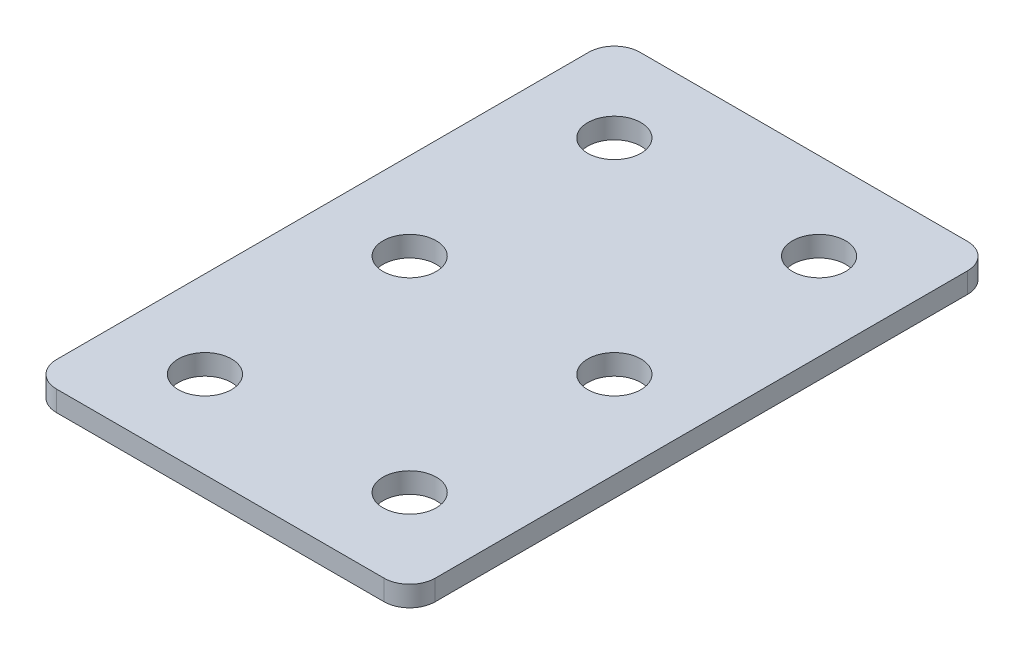
ISO-10303-21;
HEADER;
FILE_DESCRIPTION(('STEP AP214'),'2;1');
FILE_NAME('part.step','',(''),(''),'','','');
FILE_SCHEMA(('AUTOMOTIVE_DESIGN { 1 0 10303 214 1 1 1 1 }'));
ENDSEC;
DATA;
#1=APPLICATION_CONTEXT('core data for automotive mechanical design processes');
#2=APPLICATION_PROTOCOL_DEFINITION('international standard','automotive_design',2000,#1);
#3=PRODUCT_CONTEXT('',#1,'mechanical');
#4=PRODUCT('Part','Part','',(#3));
#5=PRODUCT_RELATED_PRODUCT_CATEGORY('part','',(#4));
#6=PRODUCT_DEFINITION_FORMATION('','',#4);
#7=PRODUCT_DEFINITION_CONTEXT('part definition',#1,'design');
#8=PRODUCT_DEFINITION('design','',#6,#7);
#9=PRODUCT_DEFINITION_SHAPE('','',#8);
#10=(LENGTH_UNIT() NAMED_UNIT(*) SI_UNIT(.MILLI.,.METRE.));
#11=(NAMED_UNIT(*) PLANE_ANGLE_UNIT() SI_UNIT($,.RADIAN.));
#12=(NAMED_UNIT(*) SI_UNIT($,.STERADIAN.) SOLID_ANGLE_UNIT());
#13=UNCERTAINTY_MEASURE_WITH_UNIT(LENGTH_MEASURE(1.E-05),#10,'distance_accuracy_value','');
#14=(GEOMETRIC_REPRESENTATION_CONTEXT(3) GLOBAL_UNCERTAINTY_ASSIGNED_CONTEXT((#13)) GLOBAL_UNIT_ASSIGNED_CONTEXT((#10,
#11,#12)) REPRESENTATION_CONTEXT('',''));
#15=CARTESIAN_POINT('',(0.,0.,0.));
#16=DIRECTION('',(0.,0.,1.));
#17=DIRECTION('',(1.,0.,0.));
#18=AXIS2_PLACEMENT_3D('',#15,#16,#17);
#19=CARTESIAN_POINT('',(-1.77841838404902,2.35790424429661,-21.5789401508641));
#20=DIRECTION('',(0.,-1.,0.));
#21=DIRECTION('',(0.,0.,-1.));
#22=AXIS2_PLACEMENT_3D('',#19,#20,#21);
#23=PLANE('',#22);
#24=CARTESIAN_POINT('',(8.22158161595099,2.35790424429661,18.4210598491359));
#25=DIRECTION('',(0.,1.,0.));
#26=DIRECTION('',(0.,0.,1.));
#27=AXIS2_PLACEMENT_3D('',#24,#25,#26);
#28=CIRCLE('',#27,2.6);
#29=CARTESIAN_POINT('',(8.22158161595099,2.35790424429661,21.0210598491359));
#30=VERTEX_POINT('',#29);
#31=EDGE_CURVE('E177',#30,#30,#28,.T.);
#32=ORIENTED_EDGE('',*,*,#31,.T.);
#33=EDGE_LOOP('',(#32));
#34=FACE_BOUND('',#33,.T.);
#35=CARTESIAN_POINT('',(-11.7784183840491,2.35790424429661,18.4210598491359));
#36=DIRECTION('',(0.,1.,0.));
#37=DIRECTION('',(0.,0.,1.));
#38=AXIS2_PLACEMENT_3D('',#35,#36,#37);
#39=CIRCLE('',#38,2.6);
#40=CARTESIAN_POINT('',(-11.7784183840491,2.35790424429661,21.0210598491359));
#41=VERTEX_POINT('',#40);
#42=EDGE_CURVE('E171',#41,#41,#39,.T.);
#43=ORIENTED_EDGE('',*,*,#42,.T.);
#44=EDGE_LOOP('',(#43));
#45=FACE_BOUND('',#44,.T.);
#46=CARTESIAN_POINT('',(8.22158161595099,2.35790424429661,-1.57894015086408));
#47=DIRECTION('',(0.,1.,0.));
#48=DIRECTION('',(0.,0.,1.));
#49=AXIS2_PLACEMENT_3D('',#46,#47,#48);
#50=CIRCLE('',#49,2.6);
#51=CARTESIAN_POINT('',(8.22158161595099,2.35790424429661,1.02105984913592));
#52=VERTEX_POINT('',#51);
#53=EDGE_CURVE('E165',#52,#52,#50,.T.);
#54=ORIENTED_EDGE('',*,*,#53,.T.);
#55=EDGE_LOOP('',(#54));
#56=FACE_BOUND('',#55,.T.);
#57=CARTESIAN_POINT('',(-11.7784183840491,2.35790424429661,-1.57894015086408));
#58=DIRECTION('',(0.,1.,0.));
#59=DIRECTION('',(0.,0.,1.));
#60=AXIS2_PLACEMENT_3D('',#57,#58,#59);
#61=CIRCLE('',#60,2.6);
#62=CARTESIAN_POINT('',(-11.7784183840491,2.35790424429661,1.02105984913592));
#63=VERTEX_POINT('',#62);
#64=EDGE_CURVE('E159',#63,#63,#61,.T.);
#65=ORIENTED_EDGE('',*,*,#64,.T.);
#66=EDGE_LOOP('',(#65));
#67=FACE_BOUND('',#66,.T.);
#68=CARTESIAN_POINT('',(8.221581615951,2.35790424429661,-21.5789401508641));
#69=DIRECTION('',(0.,1.,0.));
#70=DIRECTION('',(0.,0.,1.));
#71=AXIS2_PLACEMENT_3D('',#68,#69,#70);
#72=CIRCLE('',#71,2.6);
#73=CARTESIAN_POINT('',(8.221581615951,2.35790424429661,-18.9789401508641));
#74=VERTEX_POINT('',#73);
#75=EDGE_CURVE('E154',#74,#74,#72,.T.);
#76=ORIENTED_EDGE('',*,*,#75,.T.);
#77=EDGE_LOOP('',(#76));
#78=FACE_BOUND('',#77,.T.);
#79=CARTESIAN_POINT('',(-11.7784183840491,2.35790424429661,-21.5789401508641));
#80=DIRECTION('',(0.,1.,0.));
#81=DIRECTION('',(0.,0.,1.));
#82=AXIS2_PLACEMENT_3D('',#79,#80,#81);
#83=CIRCLE('',#82,2.6);
#84=CARTESIAN_POINT('',(-11.7784183840491,2.35790424429661,-18.9789401508641));
#85=VERTEX_POINT('',#84);
#86=EDGE_CURVE('E147',#85,#85,#83,.T.);
#87=ORIENTED_EDGE('',*,*,#86,.T.);
#88=EDGE_LOOP('',(#87));
#89=FACE_BOUND('',#88,.T.);
#90=DIRECTION('',(0.,0.,-1.));
#91=VECTOR('',#90,1.);
#92=CARTESIAN_POINT('',(16.721581615951,2.35790424429661,26.9210598491359));
#93=LINE('',#92,#91);
#94=CARTESIAN_POINT('',(16.721581615951,2.35790424429661,24.4210598491359));
#95=VERTEX_POINT('',#94);
#96=CARTESIAN_POINT('',(16.721581615951,2.35790424429661,-27.5789401508641));
#97=VERTEX_POINT('',#96);
#98=EDGE_CURVE('E106',#95,#97,#93,.T.);
#99=ORIENTED_EDGE('',*,*,#98,.F.);
#100=CARTESIAN_POINT('',(14.221581615951,2.35790424429661,24.4210598491359));
#101=DIRECTION('',(0.,-1.,0.));
#102=DIRECTION('',(0.,0.,-1.));
#103=AXIS2_PLACEMENT_3D('',#100,#101,#102);
#104=CIRCLE('',#103,2.5);
#105=CARTESIAN_POINT('',(14.221581615951,2.35790424429661,26.9210598491359));
#106=VERTEX_POINT('',#105);
#107=EDGE_CURVE('E128',#95,#106,#104,.T.);
#108=ORIENTED_EDGE('',*,*,#107,.T.);
#109=DIRECTION('',(1.,0.,0.));
#110=VECTOR('',#109,1.);
#111=CARTESIAN_POINT('',(-20.2784183840491,2.35790424429661,26.9210598491359));
#112=LINE('',#111,#110);
#113=CARTESIAN_POINT('',(-17.7784183840491,2.35790424429661,26.9210598491359));
#114=VERTEX_POINT('',#113);
#115=EDGE_CURVE('E110',#114,#106,#112,.T.);
#116=ORIENTED_EDGE('',*,*,#115,.F.);
#117=CARTESIAN_POINT('',(-17.7784183840491,2.35790424429661,24.4210598491359));
#118=DIRECTION('',(0.,-1.,0.));
#119=DIRECTION('',(0.,0.,-1.));
#120=AXIS2_PLACEMENT_3D('',#117,#118,#119);
#121=CIRCLE('',#120,2.5);
#122=CARTESIAN_POINT('',(-20.2784183840491,2.35790424429661,24.4210598491359));
#123=VERTEX_POINT('',#122);
#124=EDGE_CURVE('E105',#114,#123,#121,.T.);
#125=ORIENTED_EDGE('',*,*,#124,.T.);
#126=DIRECTION('',(0.,0.,1.));
#127=VECTOR('',#126,1.);
#128=CARTESIAN_POINT('',(-20.2784183840491,2.35790424429661,-30.0789401508641));
#129=LINE('',#128,#127);
#130=CARTESIAN_POINT('',(-20.2784183840491,2.35790424429661,-27.5789401508641));
#131=VERTEX_POINT('',#130);
#132=EDGE_CURVE('E137',#131,#123,#129,.T.);
#133=ORIENTED_EDGE('',*,*,#132,.F.);
#134=CARTESIAN_POINT('',(-17.7784183840491,2.35790424429661,-27.5789401508641));
#135=DIRECTION('',(0.,-1.,0.));
#136=DIRECTION('',(0.,0.,-1.));
#137=AXIS2_PLACEMENT_3D('',#134,#135,#136);
#138=CIRCLE('',#137,2.5);
#139=CARTESIAN_POINT('',(-17.7784183840491,2.35790424429661,-30.0789401508641));
#140=VERTEX_POINT('',#139);
#141=EDGE_CURVE('E31',#131,#140,#138,.T.);
#142=ORIENTED_EDGE('',*,*,#141,.T.);
#143=DIRECTION('',(-1.,0.,0.));
#144=VECTOR('',#143,1.);
#145=CARTESIAN_POINT('',(16.721581615951,2.35790424429661,-30.0789401508641));
#146=LINE('',#145,#144);
#147=CARTESIAN_POINT('',(14.221581615951,2.35790424429661,-30.0789401508641));
#148=VERTEX_POINT('',#147);
#149=EDGE_CURVE('E138',#148,#140,#146,.T.);
#150=ORIENTED_EDGE('',*,*,#149,.F.);
#151=CARTESIAN_POINT('',(14.221581615951,2.35790424429661,-27.5789401508641));
#152=DIRECTION('',(0.,-1.,0.));
#153=DIRECTION('',(0.,0.,-1.));
#154=AXIS2_PLACEMENT_3D('',#151,#152,#153);
#155=CIRCLE('',#154,2.5);
#156=EDGE_CURVE('E126',#148,#97,#155,.T.);
#157=ORIENTED_EDGE('',*,*,#156,.T.);
#158=EDGE_LOOP('',(#99,#108,#116,#125,#133,#142,#150,#157));
#159=FACE_BOUND('',#158,.T.);
#160=ADVANCED_FACE('F16',(#34,#45,#56,#67,#78,#89,#159),#23,.T.);
#161=CARTESIAN_POINT('',(16.721581615951,2.35790424429661,-30.0789401508641));
#162=DIRECTION('',(0.,0.,-1.));
#163=DIRECTION('',(-1.,0.,0.));
#164=AXIS2_PLACEMENT_3D('',#161,#162,#163);
#165=PLANE('',#164);
#166=DIRECTION('',(-1.,0.,0.));
#167=VECTOR('',#166,1.);
#168=CARTESIAN_POINT('',(16.721581615951,4.35790424429661,-30.0789401508641));
#169=LINE('',#168,#167);
#170=CARTESIAN_POINT('',(14.221581615951,4.35790424429661,-30.0789401508641));
#171=VERTEX_POINT('',#170);
#172=CARTESIAN_POINT('',(-17.7784183840491,4.35790424429661,-30.0789401508641));
#173=VERTEX_POINT('',#172);
#174=EDGE_CURVE('E144',#171,#173,#169,.T.);
#175=ORIENTED_EDGE('',*,*,#174,.F.);
#176=DIRECTION('',(0.,1.,0.));
#177=VECTOR('',#176,1.);
#178=CARTESIAN_POINT('',(14.221581615951,2.35790424429661,-30.0789401508641));
#179=LINE('',#178,#177);
#180=EDGE_CURVE('E38',#171,#148,#179,.F.);
#181=ORIENTED_EDGE('',*,*,#180,.T.);
#182=ORIENTED_EDGE('',*,*,#149,.T.);
#183=DIRECTION('',(0.,1.,0.));
#184=VECTOR('',#183,1.);
#185=CARTESIAN_POINT('',(-17.7784183840491,2.35790424429661,-30.0789401508641));
#186=LINE('',#185,#184);
#187=EDGE_CURVE('E130',#140,#173,#186,.T.);
#188=ORIENTED_EDGE('',*,*,#187,.T.);
#189=EDGE_LOOP('',(#175,#181,#182,#188));
#190=FACE_BOUND('',#189,.T.);
#191=ADVANCED_FACE('F223',(#190),#165,.T.);
#192=CARTESIAN_POINT('',(16.721581615951,2.35790424429661,26.9210598491359));
#193=DIRECTION('',(1.,0.,0.));
#194=DIRECTION('',(0.,0.,-1.));
#195=AXIS2_PLACEMENT_3D('',#192,#193,#194);
#196=PLANE('',#195);
#197=DIRECTION('',(0.,0.,-1.));
#198=VECTOR('',#197,1.);
#199=CARTESIAN_POINT('',(16.721581615951,4.35790424429661,26.9210598491359));
#200=LINE('',#199,#198);
#201=CARTESIAN_POINT('',(16.721581615951,4.35790424429661,24.4210598491359));
#202=VERTEX_POINT('',#201);
#203=CARTESIAN_POINT('',(16.721581615951,4.35790424429661,-27.5789401508641));
#204=VERTEX_POINT('',#203);
#205=EDGE_CURVE('E102',#202,#204,#200,.T.);
#206=ORIENTED_EDGE('',*,*,#205,.F.);
#207=DIRECTION('',(0.,1.,0.));
#208=VECTOR('',#207,1.);
#209=CARTESIAN_POINT('',(16.721581615951,2.35790424429661,24.4210598491359));
#210=LINE('',#209,#208);
#211=EDGE_CURVE('E122',#202,#95,#210,.F.);
#212=ORIENTED_EDGE('',*,*,#211,.T.);
#213=ORIENTED_EDGE('',*,*,#98,.T.);
#214=DIRECTION('',(0.,1.,0.));
#215=VECTOR('',#214,1.);
#216=CARTESIAN_POINT('',(16.721581615951,2.35790424429661,-27.5789401508641));
#217=LINE('',#216,#215);
#218=EDGE_CURVE('E119',#97,#204,#217,.T.);
#219=ORIENTED_EDGE('',*,*,#218,.T.);
#220=EDGE_LOOP('',(#206,#212,#213,#219));
#221=FACE_BOUND('',#220,.T.);
#222=ADVANCED_FACE('F228',(#221),#196,.T.);
#223=CARTESIAN_POINT('',(-20.2784183840491,2.35790424429661,26.9210598491359));
#224=DIRECTION('',(0.,0.,1.));
#225=DIRECTION('',(1.,0.,0.));
#226=AXIS2_PLACEMENT_3D('',#223,#224,#225);
#227=PLANE('',#226);
#228=ORIENTED_EDGE('',*,*,#115,.T.);
#229=DIRECTION('',(0.,1.,0.));
#230=VECTOR('',#229,1.);
#231=CARTESIAN_POINT('',(14.221581615951,2.35790424429661,26.9210598491359));
#232=LINE('',#231,#230);
#233=CARTESIAN_POINT('',(14.221581615951,4.35790424429661,26.9210598491359));
#234=VERTEX_POINT('',#233);
#235=EDGE_CURVE('E93',#106,#234,#232,.T.);
#236=ORIENTED_EDGE('',*,*,#235,.T.);
#237=DIRECTION('',(1.,0.,0.));
#238=VECTOR('',#237,1.);
#239=CARTESIAN_POINT('',(-20.2784183840491,4.35790424429661,26.9210598491359));
#240=LINE('',#239,#238);
#241=CARTESIAN_POINT('',(-17.7784183840491,4.35790424429661,26.9210598491359));
#242=VERTEX_POINT('',#241);
#243=EDGE_CURVE('E85',#242,#234,#240,.T.);
#244=ORIENTED_EDGE('',*,*,#243,.F.);
#245=DIRECTION('',(0.,1.,0.));
#246=VECTOR('',#245,1.);
#247=CARTESIAN_POINT('',(-17.7784183840491,2.35790424429661,26.9210598491359));
#248=LINE('',#247,#246);
#249=EDGE_CURVE('E99',#242,#114,#248,.F.);
#250=ORIENTED_EDGE('',*,*,#249,.T.);
#251=EDGE_LOOP('',(#228,#236,#244,#250));
#252=FACE_BOUND('',#251,.T.);
#253=ADVANCED_FACE('F98',(#252),#227,.T.);
#254=CARTESIAN_POINT('',(-20.2784183840491,2.35790424429661,-30.0789401508641));
#255=DIRECTION('',(-1.,0.,0.));
#256=DIRECTION('',(0.,0.,1.));
#257=AXIS2_PLACEMENT_3D('',#254,#255,#256);
#258=PLANE('',#257);
#259=DIRECTION('',(0.,0.,1.));
#260=VECTOR('',#259,1.);
#261=CARTESIAN_POINT('',(-20.2784183840491,4.35790424429661,-30.0789401508641));
#262=LINE('',#261,#260);
#263=CARTESIAN_POINT('',(-20.2784183840491,4.35790424429661,-27.5789401508641));
#264=VERTEX_POINT('',#263);
#265=CARTESIAN_POINT('',(-20.2784183840491,4.35790424429661,24.4210598491359));
#266=VERTEX_POINT('',#265);
#267=EDGE_CURVE('E87',#264,#266,#262,.T.);
#268=ORIENTED_EDGE('',*,*,#267,.F.);
#269=DIRECTION('',(0.,1.,0.));
#270=VECTOR('',#269,1.);
#271=CARTESIAN_POINT('',(-20.2784183840491,2.35790424429661,-27.5789401508641));
#272=LINE('',#271,#270);
#273=EDGE_CURVE('E10',#264,#131,#272,.F.);
#274=ORIENTED_EDGE('',*,*,#273,.T.);
#275=ORIENTED_EDGE('',*,*,#132,.T.);
#276=DIRECTION('',(0.,1.,0.));
#277=VECTOR('',#276,1.);
#278=CARTESIAN_POINT('',(-20.2784183840491,2.35790424429661,24.4210598491359));
#279=LINE('',#278,#277);
#280=EDGE_CURVE('E24',#123,#266,#279,.T.);
#281=ORIENTED_EDGE('',*,*,#280,.T.);
#282=EDGE_LOOP('',(#268,#274,#275,#281));
#283=FACE_BOUND('',#282,.T.);
#284=ADVANCED_FACE('F135',(#283),#258,.T.);
#285=CARTESIAN_POINT('',(-1.77841838404902,4.35790424429661,-21.5789401508641));
#286=DIRECTION('',(0.,-1.,0.));
#287=DIRECTION('',(0.,0.,-1.));
#288=AXIS2_PLACEMENT_3D('',#285,#286,#287);
#289=PLANE('',#288);
#290=CARTESIAN_POINT('',(8.22158161595099,4.35790424429661,18.4210598491359));
#291=DIRECTION('',(0.,1.,0.));
#292=DIRECTION('',(0.,0.,1.));
#293=AXIS2_PLACEMENT_3D('',#290,#291,#292);
#294=CIRCLE('',#293,2.6);
#295=CARTESIAN_POINT('',(8.22158161595099,4.35790424429661,21.0210598491359));
#296=VERTEX_POINT('',#295);
#297=EDGE_CURVE('E180',#296,#296,#294,.T.);
#298=ORIENTED_EDGE('',*,*,#297,.F.);
#299=EDGE_LOOP('',(#298));
#300=FACE_BOUND('',#299,.T.);
#301=CARTESIAN_POINT('',(-11.7784183840491,4.35790424429661,18.4210598491359));
#302=DIRECTION('',(0.,1.,0.));
#303=DIRECTION('',(0.,0.,1.));
#304=AXIS2_PLACEMENT_3D('',#301,#302,#303);
#305=CIRCLE('',#304,2.6);
#306=CARTESIAN_POINT('',(-11.7784183840491,4.35790424429661,21.0210598491359));
#307=VERTEX_POINT('',#306);
#308=EDGE_CURVE('E174',#307,#307,#305,.T.);
#309=ORIENTED_EDGE('',*,*,#308,.F.);
#310=EDGE_LOOP('',(#309));
#311=FACE_BOUND('',#310,.T.);
#312=CARTESIAN_POINT('',(8.22158161595099,4.35790424429661,-1.57894015086408));
#313=DIRECTION('',(0.,1.,0.));
#314=DIRECTION('',(0.,0.,1.));
#315=AXIS2_PLACEMENT_3D('',#312,#313,#314);
#316=CIRCLE('',#315,2.6);
#317=CARTESIAN_POINT('',(8.22158161595099,4.35790424429661,1.02105984913592));
#318=VERTEX_POINT('',#317);
#319=EDGE_CURVE('E168',#318,#318,#316,.T.);
#320=ORIENTED_EDGE('',*,*,#319,.F.);
#321=EDGE_LOOP('',(#320));
#322=FACE_BOUND('',#321,.T.);
#323=CARTESIAN_POINT('',(-11.7784183840491,4.35790424429661,-1.57894015086408));
#324=DIRECTION('',(0.,1.,0.));
#325=DIRECTION('',(0.,0.,1.));
#326=AXIS2_PLACEMENT_3D('',#323,#324,#325);
#327=CIRCLE('',#326,2.6);
#328=CARTESIAN_POINT('',(-11.7784183840491,4.35790424429661,1.02105984913592));
#329=VERTEX_POINT('',#328);
#330=EDGE_CURVE('E162',#329,#329,#327,.T.);
#331=ORIENTED_EDGE('',*,*,#330,.F.);
#332=EDGE_LOOP('',(#331));
#333=FACE_BOUND('',#332,.T.);
#334=CARTESIAN_POINT('',(8.221581615951,4.35790424429661,-21.5789401508641));
#335=DIRECTION('',(0.,1.,0.));
#336=DIRECTION('',(0.,0.,1.));
#337=AXIS2_PLACEMENT_3D('',#334,#335,#336);
#338=CIRCLE('',#337,2.6);
#339=CARTESIAN_POINT('',(8.221581615951,4.35790424429661,-18.9789401508641));
#340=VERTEX_POINT('',#339);
#341=EDGE_CURVE('E156',#340,#340,#338,.T.);
#342=ORIENTED_EDGE('',*,*,#341,.F.);
#343=EDGE_LOOP('',(#342));
#344=FACE_BOUND('',#343,.T.);
#345=CARTESIAN_POINT('',(-11.7784183840491,4.35790424429661,-21.5789401508641));
#346=DIRECTION('',(0.,1.,0.));
#347=DIRECTION('',(0.,0.,1.));
#348=AXIS2_PLACEMENT_3D('',#345,#346,#347);
#349=CIRCLE('',#348,2.6);
#350=CARTESIAN_POINT('',(-11.7784183840491,4.35790424429661,-18.9789401508641));
#351=VERTEX_POINT('',#350);
#352=EDGE_CURVE('E149',#351,#351,#349,.T.);
#353=ORIENTED_EDGE('',*,*,#352,.F.);
#354=EDGE_LOOP('',(#353));
#355=FACE_BOUND('',#354,.T.);
#356=ORIENTED_EDGE('',*,*,#243,.T.);
#357=CARTESIAN_POINT('',(14.221581615951,4.35790424429661,24.4210598491359));
#358=DIRECTION('',(0.,-1.,0.));
#359=DIRECTION('',(0.,0.,-1.));
#360=AXIS2_PLACEMENT_3D('',#357,#358,#359);
#361=CIRCLE('',#360,2.5);
#362=EDGE_CURVE('E117',#234,#202,#361,.F.);
#363=ORIENTED_EDGE('',*,*,#362,.T.);
#364=ORIENTED_EDGE('',*,*,#205,.T.);
#365=CARTESIAN_POINT('',(14.221581615951,4.35790424429661,-27.5789401508641));
#366=DIRECTION('',(0.,-1.,0.));
#367=DIRECTION('',(0.,0.,-1.));
#368=AXIS2_PLACEMENT_3D('',#365,#366,#367);
#369=CIRCLE('',#368,2.5);
#370=EDGE_CURVE('E115',#204,#171,#369,.F.);
#371=ORIENTED_EDGE('',*,*,#370,.T.);
#372=ORIENTED_EDGE('',*,*,#174,.T.);
#373=CARTESIAN_POINT('',(-17.7784183840491,4.35790424429661,-27.5789401508641));
#374=DIRECTION('',(0.,-1.,0.));
#375=DIRECTION('',(0.,0.,-1.));
#376=AXIS2_PLACEMENT_3D('',#373,#374,#375);
#377=CIRCLE('',#376,2.5);
#378=EDGE_CURVE('E92',#173,#264,#377,.F.);
#379=ORIENTED_EDGE('',*,*,#378,.T.);
#380=ORIENTED_EDGE('',*,*,#267,.T.);
#381=CARTESIAN_POINT('',(-17.7784183840491,4.35790424429661,24.4210598491359));
#382=DIRECTION('',(0.,-1.,0.));
#383=DIRECTION('',(0.,0.,-1.));
#384=AXIS2_PLACEMENT_3D('',#381,#382,#383);
#385=CIRCLE('',#384,2.5);
#386=EDGE_CURVE('E82',#266,#242,#385,.F.);
#387=ORIENTED_EDGE('',*,*,#386,.T.);
#388=EDGE_LOOP('',(#356,#363,#364,#371,#372,#379,#380,#387));
#389=FACE_BOUND('',#388,.T.);
#390=ADVANCED_FACE('F84',(#300,#311,#322,#333,#344,#355,#389),#289,.F.);
#391=CARTESIAN_POINT('',(-11.7784183840491,2.35790424429661,-21.5789401508641));
#392=DIRECTION('',(0.,1.,0.));
#393=DIRECTION('',(0.,0.,1.));
#394=AXIS2_PLACEMENT_3D('',#391,#392,#393);
#395=CYLINDRICAL_SURFACE('',#394,2.6);
#396=ORIENTED_EDGE('',*,*,#86,.F.);
#397=EDGE_LOOP('',(#396));
#398=FACE_BOUND('',#397,.T.);
#399=ORIENTED_EDGE('',*,*,#352,.T.);
#400=EDGE_LOOP('',(#399));
#401=FACE_BOUND('',#400,.T.);
#402=ADVANCED_FACE('F198',(#398,#401),#395,.F.);
#403=CARTESIAN_POINT('',(8.221581615951,2.35790424429661,-21.5789401508641));
#404=DIRECTION('',(0.,1.,0.));
#405=DIRECTION('',(0.,0.,1.));
#406=AXIS2_PLACEMENT_3D('',#403,#404,#405);
#407=CYLINDRICAL_SURFACE('',#406,2.6);
#408=ORIENTED_EDGE('',*,*,#75,.F.);
#409=EDGE_LOOP('',(#408));
#410=FACE_BOUND('',#409,.T.);
#411=ORIENTED_EDGE('',*,*,#341,.T.);
#412=EDGE_LOOP('',(#411));
#413=FACE_BOUND('',#412,.T.);
#414=ADVANCED_FACE('F211',(#410,#413),#407,.F.);
#415=CARTESIAN_POINT('',(-11.7784183840491,2.35790424429661,-1.57894015086408));
#416=DIRECTION('',(0.,1.,0.));
#417=DIRECTION('',(0.,0.,1.));
#418=AXIS2_PLACEMENT_3D('',#415,#416,#417);
#419=CYLINDRICAL_SURFACE('',#418,2.6);
#420=ORIENTED_EDGE('',*,*,#64,.F.);
#421=EDGE_LOOP('',(#420));
#422=FACE_BOUND('',#421,.T.);
#423=ORIENTED_EDGE('',*,*,#330,.T.);
#424=EDGE_LOOP('',(#423));
#425=FACE_BOUND('',#424,.T.);
#426=ADVANCED_FACE('F218',(#422,#425),#419,.F.);
#427=CARTESIAN_POINT('',(8.22158161595099,2.35790424429661,-1.57894015086408));
#428=DIRECTION('',(0.,1.,0.));
#429=DIRECTION('',(0.,0.,1.));
#430=AXIS2_PLACEMENT_3D('',#427,#428,#429);
#431=CYLINDRICAL_SURFACE('',#430,2.6);
#432=ORIENTED_EDGE('',*,*,#53,.F.);
#433=EDGE_LOOP('',(#432));
#434=FACE_BOUND('',#433,.T.);
#435=ORIENTED_EDGE('',*,*,#319,.T.);
#436=EDGE_LOOP('',(#435));
#437=FACE_BOUND('',#436,.T.);
#438=ADVANCED_FACE('F291',(#434,#437),#431,.F.);
#439=CARTESIAN_POINT('',(-11.7784183840491,2.35790424429661,18.4210598491359));
#440=DIRECTION('',(0.,1.,0.));
#441=DIRECTION('',(0.,0.,1.));
#442=AXIS2_PLACEMENT_3D('',#439,#440,#441);
#443=CYLINDRICAL_SURFACE('',#442,2.6);
#444=ORIENTED_EDGE('',*,*,#42,.F.);
#445=EDGE_LOOP('',(#444));
#446=FACE_BOUND('',#445,.T.);
#447=ORIENTED_EDGE('',*,*,#308,.T.);
#448=EDGE_LOOP('',(#447));
#449=FACE_BOUND('',#448,.T.);
#450=ADVANCED_FACE('F192',(#446,#449),#443,.F.);
#451=CARTESIAN_POINT('',(8.22158161595099,2.35790424429661,18.4210598491359));
#452=DIRECTION('',(0.,1.,0.));
#453=DIRECTION('',(0.,0.,1.));
#454=AXIS2_PLACEMENT_3D('',#451,#452,#453);
#455=CYLINDRICAL_SURFACE('',#454,2.6);
#456=ORIENTED_EDGE('',*,*,#31,.F.);
#457=EDGE_LOOP('',(#456));
#458=FACE_BOUND('',#457,.T.);
#459=ORIENTED_EDGE('',*,*,#297,.T.);
#460=EDGE_LOOP('',(#459));
#461=FACE_BOUND('',#460,.T.);
#462=ADVANCED_FACE('F188',(#458,#461),#455,.F.);
#463=CARTESIAN_POINT('',(14.221581615951,2.35790424429661,24.4210598491359));
#464=DIRECTION('',(0.,1.,0.));
#465=DIRECTION('',(0.,0.,1.));
#466=AXIS2_PLACEMENT_3D('',#463,#464,#465);
#467=CYLINDRICAL_SURFACE('',#466,2.5);
#468=ORIENTED_EDGE('',*,*,#107,.F.);
#469=ORIENTED_EDGE('',*,*,#211,.F.);
#470=ORIENTED_EDGE('',*,*,#362,.F.);
#471=ORIENTED_EDGE('',*,*,#235,.F.);
#472=EDGE_LOOP('',(#468,#469,#470,#471));
#473=FACE_BOUND('',#472,.T.);
#474=ADVANCED_FACE('F191',(#473),#467,.T.);
#475=CARTESIAN_POINT('',(14.221581615951,2.35790424429661,-27.5789401508641));
#476=DIRECTION('',(0.,1.,0.));
#477=DIRECTION('',(0.,0.,1.));
#478=AXIS2_PLACEMENT_3D('',#475,#476,#477);
#479=CYLINDRICAL_SURFACE('',#478,2.5);
#480=ORIENTED_EDGE('',*,*,#156,.F.);
#481=ORIENTED_EDGE('',*,*,#180,.F.);
#482=ORIENTED_EDGE('',*,*,#370,.F.);
#483=ORIENTED_EDGE('',*,*,#218,.F.);
#484=EDGE_LOOP('',(#480,#481,#482,#483));
#485=FACE_BOUND('',#484,.T.);
#486=ADVANCED_FACE('F233',(#485),#479,.T.);
#487=CARTESIAN_POINT('',(-17.7784183840491,2.35790424429661,-27.5789401508641));
#488=DIRECTION('',(0.,1.,0.));
#489=DIRECTION('',(0.,0.,1.));
#490=AXIS2_PLACEMENT_3D('',#487,#488,#489);
#491=CYLINDRICAL_SURFACE('',#490,2.5);
#492=ORIENTED_EDGE('',*,*,#141,.F.);
#493=ORIENTED_EDGE('',*,*,#273,.F.);
#494=ORIENTED_EDGE('',*,*,#378,.F.);
#495=ORIENTED_EDGE('',*,*,#187,.F.);
#496=EDGE_LOOP('',(#492,#493,#494,#495));
#497=FACE_BOUND('',#496,.T.);
#498=ADVANCED_FACE('F236',(#497),#491,.T.);
#499=CARTESIAN_POINT('',(-17.7784183840491,2.35790424429661,24.4210598491359));
#500=DIRECTION('',(0.,1.,0.));
#501=DIRECTION('',(0.,0.,1.));
#502=AXIS2_PLACEMENT_3D('',#499,#500,#501);
#503=CYLINDRICAL_SURFACE('',#502,2.5);
#504=ORIENTED_EDGE('',*,*,#124,.F.);
#505=ORIENTED_EDGE('',*,*,#249,.F.);
#506=ORIENTED_EDGE('',*,*,#386,.F.);
#507=ORIENTED_EDGE('',*,*,#280,.F.);
#508=EDGE_LOOP('',(#504,#505,#506,#507));
#509=FACE_BOUND('',#508,.T.);
#510=ADVANCED_FACE('F18',(#509),#503,.T.);
#511=CLOSED_SHELL('',(#160,#191,#222,#253,#284,#390,#402,#414,#426,#438,#450,#462,#474,#486,
#498,#510));
#512=MANIFOLD_SOLID_BREP('B1',#511);
#513=ADVANCED_BREP_SHAPE_REPRESENTATION('',(#18,#512),#14);
#514=SHAPE_DEFINITION_REPRESENTATION(#9,#513);
ENDSEC;
END-ISO-10303-21;
